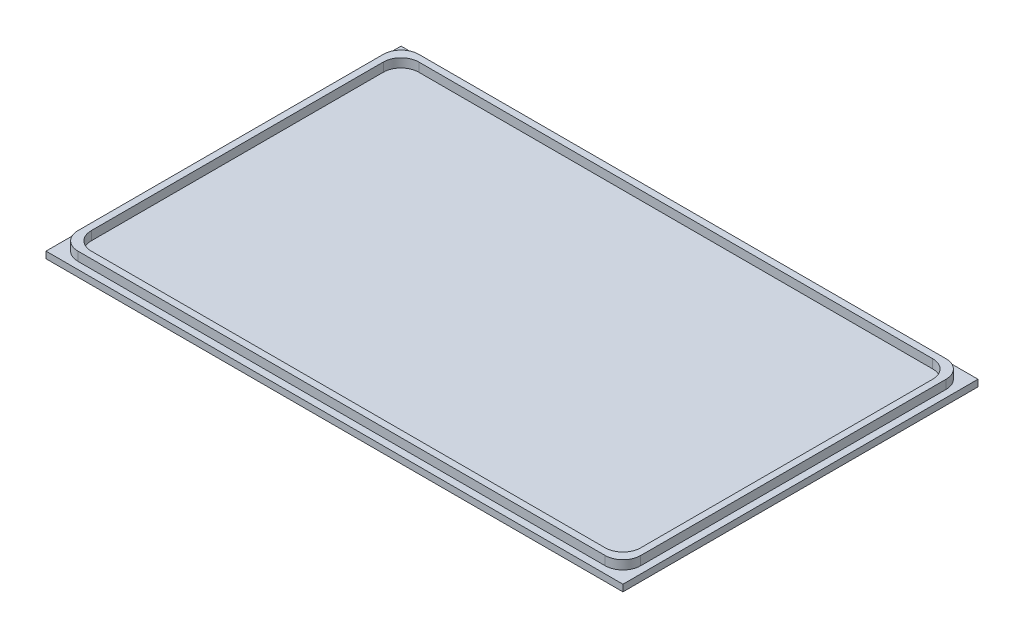
ISO-10303-21;
HEADER;
FILE_DESCRIPTION(('STEP AP214'),'2;1');
FILE_NAME('part.step','',(''),(''),'','','');
FILE_SCHEMA(('AUTOMOTIVE_DESIGN { 1 0 10303 214 1 1 1 1 }'));
ENDSEC;
DATA;
#1=APPLICATION_CONTEXT('core data for automotive mechanical design processes');
#2=APPLICATION_PROTOCOL_DEFINITION('international standard','automotive_design',2000,#1);
#3=PRODUCT_CONTEXT('',#1,'mechanical');
#4=PRODUCT('Part','Part','',(#3));
#5=PRODUCT_RELATED_PRODUCT_CATEGORY('part','',(#4));
#6=PRODUCT_DEFINITION_FORMATION('','',#4);
#7=PRODUCT_DEFINITION_CONTEXT('part definition',#1,'design');
#8=PRODUCT_DEFINITION('design','',#6,#7);
#9=PRODUCT_DEFINITION_SHAPE('','',#8);
#10=(LENGTH_UNIT() NAMED_UNIT(*) SI_UNIT(.MILLI.,.METRE.));
#11=(NAMED_UNIT(*) PLANE_ANGLE_UNIT() SI_UNIT($,.RADIAN.));
#12=(NAMED_UNIT(*) SI_UNIT($,.STERADIAN.) SOLID_ANGLE_UNIT());
#13=UNCERTAINTY_MEASURE_WITH_UNIT(LENGTH_MEASURE(1.E-05),#10,'distance_accuracy_value','');
#14=(GEOMETRIC_REPRESENTATION_CONTEXT(3) GLOBAL_UNCERTAINTY_ASSIGNED_CONTEXT((#13)) GLOBAL_UNIT_ASSIGNED_CONTEXT((#10,
#11,#12)) REPRESENTATION_CONTEXT('',''));
#15=CARTESIAN_POINT('',(0.,0.,0.));
#16=DIRECTION('',(0.,0.,1.));
#17=DIRECTION('',(1.,0.,0.));
#18=AXIS2_PLACEMENT_3D('',#15,#16,#17);
#19=CARTESIAN_POINT('',(0.,3.,0.));
#20=DIRECTION('',(0.,-1.,0.));
#21=DIRECTION('',(0.,0.,-1.));
#22=AXIS2_PLACEMENT_3D('',#19,#20,#21);
#23=PLANE('',#22);
#24=DIRECTION('',(0.,0.,-1.));
#25=VECTOR('',#24,1.);
#26=CARTESIAN_POINT('',(130.,3.,80.));
#27=LINE('',#26,#25);
#28=CARTESIAN_POINT('',(130.,3.,80.));
#29=VERTEX_POINT('',#28);
#30=CARTESIAN_POINT('',(130.,3.,-80.));
#31=VERTEX_POINT('',#30);
#32=EDGE_CURVE('E185',#29,#31,#27,.T.);
#33=ORIENTED_EDGE('',*,*,#32,.T.);
#34=DIRECTION('',(-1.,0.,0.));
#35=VECTOR('',#34,1.);
#36=CARTESIAN_POINT('',(-130.,3.,-80.));
#37=LINE('',#36,#35);
#38=CARTESIAN_POINT('',(-130.,3.,-80.));
#39=VERTEX_POINT('',#38);
#40=EDGE_CURVE('E174',#31,#39,#37,.T.);
#41=ORIENTED_EDGE('',*,*,#40,.T.);
#42=DIRECTION('',(0.,0.,1.));
#43=VECTOR('',#42,1.);
#44=CARTESIAN_POINT('',(-130.,3.,80.));
#45=LINE('',#44,#43);
#46=CARTESIAN_POINT('',(-130.,3.,80.));
#47=VERTEX_POINT('',#46);
#48=EDGE_CURVE('E184',#39,#47,#45,.T.);
#49=ORIENTED_EDGE('',*,*,#48,.T.);
#50=DIRECTION('',(1.,0.,0.));
#51=VECTOR('',#50,1.);
#52=CARTESIAN_POINT('',(-130.,3.,80.));
#53=LINE('',#52,#51);
#54=EDGE_CURVE('E189',#47,#29,#53,.T.);
#55=ORIENTED_EDGE('',*,*,#54,.T.);
#56=EDGE_LOOP('',(#33,#41,#49,#55));
#57=FACE_BOUND('',#56,.T.);
#58=DIRECTION('',(1.,0.,0.));
#59=VECTOR('',#58,1.);
#60=CARTESIAN_POINT('',(-126.8,3.,76.8));
#61=LINE('',#60,#59);
#62=CARTESIAN_POINT('',(-118.8,3.,76.8));
#63=VERTEX_POINT('',#62);
#64=CARTESIAN_POINT('',(118.8,3.,76.8));
#65=VERTEX_POINT('',#64);
#66=EDGE_CURVE('E300',#63,#65,#61,.T.);
#67=ORIENTED_EDGE('',*,*,#66,.F.);
#68=CARTESIAN_POINT('',(-118.8,3.,68.8));
#69=DIRECTION('',(0.,-1.,0.));
#70=DIRECTION('',(0.,0.,-1.));
#71=AXIS2_PLACEMENT_3D('',#68,#69,#70);
#72=CIRCLE('',#71,8.);
#73=CARTESIAN_POINT('',(-126.8,3.,68.8));
#74=VERTEX_POINT('',#73);
#75=EDGE_CURVE('E52',#63,#74,#72,.T.);
#76=ORIENTED_EDGE('',*,*,#75,.T.);
#77=DIRECTION('',(0.,0.,1.));
#78=VECTOR('',#77,1.);
#79=CARTESIAN_POINT('',(-126.8,3.,-76.8));
#80=LINE('',#79,#78);
#81=CARTESIAN_POINT('',(-126.8,3.,-68.8));
#82=VERTEX_POINT('',#81);
#83=EDGE_CURVE('E271',#82,#74,#80,.T.);
#84=ORIENTED_EDGE('',*,*,#83,.F.);
#85=CARTESIAN_POINT('',(-118.8,3.,-68.8));
#86=DIRECTION('',(0.,-1.,0.));
#87=DIRECTION('',(0.,0.,-1.));
#88=AXIS2_PLACEMENT_3D('',#85,#86,#87);
#89=CIRCLE('',#88,8.);
#90=CARTESIAN_POINT('',(-118.8,3.,-76.8));
#91=VERTEX_POINT('',#90);
#92=EDGE_CURVE('E45',#82,#91,#89,.T.);
#93=ORIENTED_EDGE('',*,*,#92,.T.);
#94=DIRECTION('',(-1.,0.,0.));
#95=VECTOR('',#94,1.);
#96=CARTESIAN_POINT('',(126.8,3.,-76.8));
#97=LINE('',#96,#95);
#98=CARTESIAN_POINT('',(118.8,3.,-76.8));
#99=VERTEX_POINT('',#98);
#100=EDGE_CURVE('E270',#99,#91,#97,.T.);
#101=ORIENTED_EDGE('',*,*,#100,.F.);
#102=CARTESIAN_POINT('',(118.8,3.,-68.8));
#103=DIRECTION('',(0.,-1.,0.));
#104=DIRECTION('',(0.,0.,-1.));
#105=AXIS2_PLACEMENT_3D('',#102,#103,#104);
#106=CIRCLE('',#105,8.);
#107=CARTESIAN_POINT('',(126.8,3.,-68.8));
#108=VERTEX_POINT('',#107);
#109=EDGE_CURVE('E258',#99,#108,#106,.T.);
#110=ORIENTED_EDGE('',*,*,#109,.T.);
#111=DIRECTION('',(0.,0.,-1.));
#112=VECTOR('',#111,1.);
#113=CARTESIAN_POINT('',(126.8,3.,76.8));
#114=LINE('',#113,#112);
#115=CARTESIAN_POINT('',(126.8,3.,68.8));
#116=VERTEX_POINT('',#115);
#117=EDGE_CURVE('E277',#116,#108,#114,.T.);
#118=ORIENTED_EDGE('',*,*,#117,.F.);
#119=CARTESIAN_POINT('',(118.8,3.,68.8));
#120=DIRECTION('',(0.,-1.,0.));
#121=DIRECTION('',(0.,0.,-1.));
#122=AXIS2_PLACEMENT_3D('',#119,#120,#121);
#123=CIRCLE('',#122,8.);
#124=EDGE_CURVE('E264',#116,#65,#123,.T.);
#125=ORIENTED_EDGE('',*,*,#124,.T.);
#126=EDGE_LOOP('',(#67,#76,#84,#93,#101,#110,#118,#125));
#127=FACE_BOUND('',#126,.T.);
#128=ADVANCED_FACE('F37',(#57,#127),#23,.F.);
#129=CARTESIAN_POINT('',(130.,3.,80.));
#130=DIRECTION('',(-1.,0.,0.));
#131=DIRECTION('',(0.,0.,1.));
#132=AXIS2_PLACEMENT_3D('',#129,#130,#131);
#133=PLANE('',#132);
#134=DIRECTION('',(0.,0.,-1.));
#135=VECTOR('',#134,1.);
#136=CARTESIAN_POINT('',(130.,0.,80.));
#137=LINE('',#136,#135);
#138=CARTESIAN_POINT('',(130.,0.,80.));
#139=VERTEX_POINT('',#138);
#140=CARTESIAN_POINT('',(130.,0.,-80.));
#141=VERTEX_POINT('',#140);
#142=EDGE_CURVE('E197',#139,#141,#137,.T.);
#143=ORIENTED_EDGE('',*,*,#142,.T.);
#144=DIRECTION('',(0.,-1.,0.));
#145=VECTOR('',#144,1.);
#146=CARTESIAN_POINT('',(130.,3.,-80.));
#147=LINE('',#146,#145);
#148=EDGE_CURVE('E178',#31,#141,#147,.T.);
#149=ORIENTED_EDGE('',*,*,#148,.F.);
#150=ORIENTED_EDGE('',*,*,#32,.F.);
#151=DIRECTION('',(0.,-1.,0.));
#152=VECTOR('',#151,1.);
#153=CARTESIAN_POINT('',(130.,3.,80.));
#154=LINE('',#153,#152);
#155=EDGE_CURVE('E309',#29,#139,#154,.T.);
#156=ORIENTED_EDGE('',*,*,#155,.T.);
#157=EDGE_LOOP('',(#143,#149,#150,#156));
#158=FACE_BOUND('',#157,.T.);
#159=ADVANCED_FACE('F195',(#158),#133,.F.);
#160=CARTESIAN_POINT('',(-130.,3.,-80.));
#161=DIRECTION('',(0.,0.,1.));
#162=DIRECTION('',(1.,0.,0.));
#163=AXIS2_PLACEMENT_3D('',#160,#161,#162);
#164=PLANE('',#163);
#165=DIRECTION('',(-1.,0.,0.));
#166=VECTOR('',#165,1.);
#167=CARTESIAN_POINT('',(-130.,0.,-80.));
#168=LINE('',#167,#166);
#169=CARTESIAN_POINT('',(-130.,0.,-80.));
#170=VERTEX_POINT('',#169);
#171=EDGE_CURVE('E294',#141,#170,#168,.T.);
#172=ORIENTED_EDGE('',*,*,#171,.T.);
#173=DIRECTION('',(0.,-1.,0.));
#174=VECTOR('',#173,1.);
#175=CARTESIAN_POINT('',(-130.,3.,-80.));
#176=LINE('',#175,#174);
#177=EDGE_CURVE('E181',#39,#170,#176,.T.);
#178=ORIENTED_EDGE('',*,*,#177,.F.);
#179=ORIENTED_EDGE('',*,*,#40,.F.);
#180=ORIENTED_EDGE('',*,*,#148,.T.);
#181=EDGE_LOOP('',(#172,#178,#179,#180));
#182=FACE_BOUND('',#181,.T.);
#183=ADVANCED_FACE('F176',(#182),#164,.F.);
#184=CARTESIAN_POINT('',(-130.,3.,80.));
#185=DIRECTION('',(1.,0.,0.));
#186=DIRECTION('',(0.,0.,-1.));
#187=AXIS2_PLACEMENT_3D('',#184,#185,#186);
#188=PLANE('',#187);
#189=DIRECTION('',(0.,0.,1.));
#190=VECTOR('',#189,1.);
#191=CARTESIAN_POINT('',(-130.,0.,80.));
#192=LINE('',#191,#190);
#193=CARTESIAN_POINT('',(-130.,0.,80.));
#194=VERTEX_POINT('',#193);
#195=EDGE_CURVE('E312',#170,#194,#192,.T.);
#196=ORIENTED_EDGE('',*,*,#195,.T.);
#197=DIRECTION('',(0.,-1.,0.));
#198=VECTOR('',#197,1.);
#199=CARTESIAN_POINT('',(-130.,3.,80.));
#200=LINE('',#199,#198);
#201=EDGE_CURVE('E202',#47,#194,#200,.T.);
#202=ORIENTED_EDGE('',*,*,#201,.F.);
#203=ORIENTED_EDGE('',*,*,#48,.F.);
#204=ORIENTED_EDGE('',*,*,#177,.T.);
#205=EDGE_LOOP('',(#196,#202,#203,#204));
#206=FACE_BOUND('',#205,.T.);
#207=ADVANCED_FACE('F324',(#206),#188,.F.);
#208=CARTESIAN_POINT('',(-130.,3.,80.));
#209=DIRECTION('',(0.,0.,-1.));
#210=DIRECTION('',(-1.,0.,0.));
#211=AXIS2_PLACEMENT_3D('',#208,#209,#210);
#212=PLANE('',#211);
#213=DIRECTION('',(1.,0.,0.));
#214=VECTOR('',#213,1.);
#215=CARTESIAN_POINT('',(-130.,0.,80.));
#216=LINE('',#215,#214);
#217=EDGE_CURVE('E193',#194,#139,#216,.T.);
#218=ORIENTED_EDGE('',*,*,#217,.T.);
#219=ORIENTED_EDGE('',*,*,#155,.F.);
#220=ORIENTED_EDGE('',*,*,#54,.F.);
#221=ORIENTED_EDGE('',*,*,#201,.T.);
#222=EDGE_LOOP('',(#218,#219,#220,#221));
#223=FACE_BOUND('',#222,.T.);
#224=ADVANCED_FACE('F319',(#223),#212,.F.);
#225=CARTESIAN_POINT('',(0.,0.,0.));
#226=DIRECTION('',(0.,-1.,0.));
#227=DIRECTION('',(0.,0.,-1.));
#228=AXIS2_PLACEMENT_3D('',#225,#226,#227);
#229=PLANE('',#228);
#230=ORIENTED_EDGE('',*,*,#142,.F.);
#231=ORIENTED_EDGE('',*,*,#217,.F.);
#232=ORIENTED_EDGE('',*,*,#195,.F.);
#233=ORIENTED_EDGE('',*,*,#171,.F.);
#234=EDGE_LOOP('',(#230,#231,#232,#233));
#235=FACE_BOUND('',#234,.T.);
#236=ADVANCED_FACE('F323',(#235),#229,.T.);
#237=CARTESIAN_POINT('',(0.,7.,0.));
#238=DIRECTION('',(0.,1.,0.));
#239=DIRECTION('',(0.,0.,1.));
#240=AXIS2_PLACEMENT_3D('',#237,#238,#239);
#241=PLANE('',#240);
#242=DIRECTION('',(0.,0.,-1.));
#243=VECTOR('',#242,1.);
#244=CARTESIAN_POINT('',(126.8,7.,76.8));
#245=LINE('',#244,#243);
#246=CARTESIAN_POINT('',(126.8,7.,68.8));
#247=VERTEX_POINT('',#246);
#248=CARTESIAN_POINT('',(126.8,7.,-68.8));
#249=VERTEX_POINT('',#248);
#250=EDGE_CURVE('E296',#247,#249,#245,.T.);
#251=ORIENTED_EDGE('',*,*,#250,.T.);
#252=CARTESIAN_POINT('',(118.8,7.,-68.8));
#253=DIRECTION('',(0.,1.,0.));
#254=DIRECTION('',(0.,0.,1.));
#255=AXIS2_PLACEMENT_3D('',#252,#253,#254);
#256=CIRCLE('',#255,8.);
#257=CARTESIAN_POINT('',(118.8,7.,-76.8));
#258=VERTEX_POINT('',#257);
#259=EDGE_CURVE('E219',#249,#258,#256,.T.);
#260=ORIENTED_EDGE('',*,*,#259,.T.);
#261=DIRECTION('',(-1.,0.,0.));
#262=VECTOR('',#261,1.);
#263=CARTESIAN_POINT('',(126.8,7.,-76.8));
#264=LINE('',#263,#262);
#265=CARTESIAN_POINT('',(-118.8,7.,-76.8));
#266=VERTEX_POINT('',#265);
#267=EDGE_CURVE('E289',#258,#266,#264,.T.);
#268=ORIENTED_EDGE('',*,*,#267,.T.);
#269=CARTESIAN_POINT('',(-118.8,7.,-68.8));
#270=DIRECTION('',(0.,1.,0.));
#271=DIRECTION('',(0.,0.,1.));
#272=AXIS2_PLACEMENT_3D('',#269,#270,#271);
#273=CIRCLE('',#272,8.);
#274=CARTESIAN_POINT('',(-126.8,7.,-68.8));
#275=VERTEX_POINT('',#274);
#276=EDGE_CURVE('E213',#266,#275,#273,.T.);
#277=ORIENTED_EDGE('',*,*,#276,.T.);
#278=DIRECTION('',(0.,0.,1.));
#279=VECTOR('',#278,1.);
#280=CARTESIAN_POINT('',(-126.8,7.,-76.8));
#281=LINE('',#280,#279);
#282=CARTESIAN_POINT('',(-126.8,7.,68.8));
#283=VERTEX_POINT('',#282);
#284=EDGE_CURVE('E287',#275,#283,#281,.T.);
#285=ORIENTED_EDGE('',*,*,#284,.T.);
#286=CARTESIAN_POINT('',(-118.8,7.,68.8));
#287=DIRECTION('',(0.,1.,0.));
#288=DIRECTION('',(0.,0.,1.));
#289=AXIS2_PLACEMENT_3D('',#286,#287,#288);
#290=CIRCLE('',#289,8.);
#291=CARTESIAN_POINT('',(-118.8,7.,76.8));
#292=VERTEX_POINT('',#291);
#293=EDGE_CURVE('E215',#283,#292,#290,.T.);
#294=ORIENTED_EDGE('',*,*,#293,.T.);
#295=DIRECTION('',(1.,0.,0.));
#296=VECTOR('',#295,1.);
#297=CARTESIAN_POINT('',(-126.8,7.,76.8));
#298=LINE('',#297,#296);
#299=CARTESIAN_POINT('',(118.8,7.,76.8));
#300=VERTEX_POINT('',#299);
#301=EDGE_CURVE('E306',#292,#300,#298,.T.);
#302=ORIENTED_EDGE('',*,*,#301,.T.);
#303=CARTESIAN_POINT('',(118.8,7.,68.8));
#304=DIRECTION('',(0.,1.,0.));
#305=DIRECTION('',(0.,0.,1.));
#306=AXIS2_PLACEMENT_3D('',#303,#304,#305);
#307=CIRCLE('',#306,8.);
#308=EDGE_CURVE('E217',#300,#247,#307,.T.);
#309=ORIENTED_EDGE('',*,*,#308,.T.);
#310=EDGE_LOOP('',(#251,#260,#268,#277,#285,#294,#302,#309));
#311=FACE_BOUND('',#310,.T.);
#312=DIRECTION('',(0.,0.,-1.));
#313=VECTOR('',#312,1.);
#314=CARTESIAN_POINT('',(123.8,7.,73.8));
#315=LINE('',#314,#313);
#316=CARTESIAN_POINT('',(123.8,7.,65.8));
#317=VERTEX_POINT('',#316);
#318=CARTESIAN_POINT('',(123.8,7.,-65.8));
#319=VERTEX_POINT('',#318);
#320=EDGE_CURVE('E424',#317,#319,#315,.T.);
#321=ORIENTED_EDGE('',*,*,#320,.F.);
#322=CARTESIAN_POINT('',(115.8,7.,65.8));
#323=DIRECTION('',(0.,1.,0.));
#324=DIRECTION('',(0.,0.,1.));
#325=AXIS2_PLACEMENT_3D('',#322,#323,#324);
#326=CIRCLE('',#325,8.);
#327=CARTESIAN_POINT('',(115.8,7.,73.8));
#328=VERTEX_POINT('',#327);
#329=EDGE_CURVE('E262',#317,#328,#326,.F.);
#330=ORIENTED_EDGE('',*,*,#329,.T.);
#331=DIRECTION('',(1.,0.,0.));
#332=VECTOR('',#331,1.);
#333=CARTESIAN_POINT('',(-123.8,7.,73.8));
#334=LINE('',#333,#332);
#335=CARTESIAN_POINT('',(-115.8,7.,73.8));
#336=VERTEX_POINT('',#335);
#337=EDGE_CURVE('E374',#336,#328,#334,.T.);
#338=ORIENTED_EDGE('',*,*,#337,.F.);
#339=CARTESIAN_POINT('',(-115.8,7.,65.8));
#340=DIRECTION('',(0.,1.,0.));
#341=DIRECTION('',(0.,0.,1.));
#342=AXIS2_PLACEMENT_3D('',#339,#340,#341);
#343=CIRCLE('',#342,8.);
#344=CARTESIAN_POINT('',(-123.8,7.,65.8));
#345=VERTEX_POINT('',#344);
#346=EDGE_CURVE('E267',#336,#345,#343,.F.);
#347=ORIENTED_EDGE('',*,*,#346,.T.);
#348=DIRECTION('',(0.,0.,1.));
#349=VECTOR('',#348,1.);
#350=CARTESIAN_POINT('',(-123.8,7.,-73.8));
#351=LINE('',#350,#349);
#352=CARTESIAN_POINT('',(-123.8,7.,-65.8));
#353=VERTEX_POINT('',#352);
#354=EDGE_CURVE('E303',#353,#345,#351,.T.);
#355=ORIENTED_EDGE('',*,*,#354,.F.);
#356=CARTESIAN_POINT('',(-115.8,7.,-65.8));
#357=DIRECTION('',(0.,1.,0.));
#358=DIRECTION('',(0.,0.,1.));
#359=AXIS2_PLACEMENT_3D('',#356,#357,#358);
#360=CIRCLE('',#359,8.);
#361=CARTESIAN_POINT('',(-115.8,7.,-73.8));
#362=VERTEX_POINT('',#361);
#363=EDGE_CURVE('E11',#353,#362,#360,.F.);
#364=ORIENTED_EDGE('',*,*,#363,.T.);
#365=DIRECTION('',(-1.,0.,0.));
#366=VECTOR('',#365,1.);
#367=CARTESIAN_POINT('',(123.8,7.,-73.8));
#368=LINE('',#367,#366);
#369=CARTESIAN_POINT('',(115.8,7.,-73.8));
#370=VERTEX_POINT('',#369);
#371=EDGE_CURVE('E419',#370,#362,#368,.T.);
#372=ORIENTED_EDGE('',*,*,#371,.F.);
#373=CARTESIAN_POINT('',(115.8,7.,-65.8));
#374=DIRECTION('',(0.,1.,0.));
#375=DIRECTION('',(0.,0.,1.));
#376=AXIS2_PLACEMENT_3D('',#373,#374,#375);
#377=CIRCLE('',#376,8.);
#378=EDGE_CURVE('E260',#370,#319,#377,.F.);
#379=ORIENTED_EDGE('',*,*,#378,.T.);
#380=EDGE_LOOP('',(#321,#330,#338,#347,#355,#364,#372,#379));
#381=FACE_BOUND('',#380,.T.);
#382=ADVANCED_FACE('F285',(#311,#381),#241,.T.);
#383=CARTESIAN_POINT('',(-126.8,7.,76.8));
#384=DIRECTION('',(0.,0.,-1.));
#385=DIRECTION('',(-1.,0.,0.));
#386=AXIS2_PLACEMENT_3D('',#383,#384,#385);
#387=PLANE('',#386);
#388=ORIENTED_EDGE('',*,*,#66,.T.);
#389=DIRECTION('',(0.,-1.,0.));
#390=VECTOR('',#389,1.);
#391=CARTESIAN_POINT('',(118.8,7.,76.8));
#392=LINE('',#391,#390);
#393=EDGE_CURVE('E247',#65,#300,#392,.F.);
#394=ORIENTED_EDGE('',*,*,#393,.T.);
#395=ORIENTED_EDGE('',*,*,#301,.F.);
#396=DIRECTION('',(0.,-1.,0.));
#397=VECTOR('',#396,1.);
#398=CARTESIAN_POINT('',(-118.8,7.,76.8));
#399=LINE('',#398,#397);
#400=EDGE_CURVE('E244',#292,#63,#399,.T.);
#401=ORIENTED_EDGE('',*,*,#400,.T.);
#402=EDGE_LOOP('',(#388,#394,#395,#401));
#403=FACE_BOUND('',#402,.T.);
#404=ADVANCED_FACE('F388',(#403),#387,.F.);
#405=CARTESIAN_POINT('',(126.8,7.,76.8));
#406=DIRECTION('',(-1.,0.,0.));
#407=DIRECTION('',(0.,0.,1.));
#408=AXIS2_PLACEMENT_3D('',#405,#406,#407);
#409=PLANE('',#408);
#410=ORIENTED_EDGE('',*,*,#117,.T.);
#411=DIRECTION('',(0.,-1.,0.));
#412=VECTOR('',#411,1.);
#413=CARTESIAN_POINT('',(126.8,7.,-68.8));
#414=LINE('',#413,#412);
#415=EDGE_CURVE('E211',#108,#249,#414,.F.);
#416=ORIENTED_EDGE('',*,*,#415,.T.);
#417=ORIENTED_EDGE('',*,*,#250,.F.);
#418=DIRECTION('',(0.,-1.,0.));
#419=VECTOR('',#418,1.);
#420=CARTESIAN_POINT('',(126.8,7.,68.8));
#421=LINE('',#420,#419);
#422=EDGE_CURVE('E208',#247,#116,#421,.T.);
#423=ORIENTED_EDGE('',*,*,#422,.T.);
#424=EDGE_LOOP('',(#410,#416,#417,#423));
#425=FACE_BOUND('',#424,.T.);
#426=ADVANCED_FACE('F383',(#425),#409,.F.);
#427=CARTESIAN_POINT('',(126.8,7.,-76.8));
#428=DIRECTION('',(0.,0.,1.));
#429=DIRECTION('',(1.,0.,0.));
#430=AXIS2_PLACEMENT_3D('',#427,#428,#429);
#431=PLANE('',#430);
#432=ORIENTED_EDGE('',*,*,#267,.F.);
#433=DIRECTION('',(0.,-1.,0.));
#434=VECTOR('',#433,1.);
#435=CARTESIAN_POINT('',(118.8,7.,-76.8));
#436=LINE('',#435,#434);
#437=EDGE_CURVE('E200',#258,#99,#436,.T.);
#438=ORIENTED_EDGE('',*,*,#437,.T.);
#439=ORIENTED_EDGE('',*,*,#100,.T.);
#440=DIRECTION('',(0.,-1.,0.));
#441=VECTOR('',#440,1.);
#442=CARTESIAN_POINT('',(-118.8,7.,-76.8));
#443=LINE('',#442,#441);
#444=EDGE_CURVE('E198',#91,#266,#443,.F.);
#445=ORIENTED_EDGE('',*,*,#444,.T.);
#446=EDGE_LOOP('',(#432,#438,#439,#445));
#447=FACE_BOUND('',#446,.T.);
#448=ADVANCED_FACE('F274',(#447),#431,.F.);
#449=CARTESIAN_POINT('',(-126.8,7.,-76.8));
#450=DIRECTION('',(1.,0.,0.));
#451=DIRECTION('',(0.,0.,-1.));
#452=AXIS2_PLACEMENT_3D('',#449,#450,#451);
#453=PLANE('',#452);
#454=ORIENTED_EDGE('',*,*,#83,.T.);
#455=DIRECTION('',(0.,-1.,0.));
#456=VECTOR('',#455,1.);
#457=CARTESIAN_POINT('',(-126.8,7.,68.8));
#458=LINE('',#457,#456);
#459=EDGE_CURVE('E251',#74,#283,#458,.F.);
#460=ORIENTED_EDGE('',*,*,#459,.T.);
#461=ORIENTED_EDGE('',*,*,#284,.F.);
#462=DIRECTION('',(0.,-1.,0.));
#463=VECTOR('',#462,1.);
#464=CARTESIAN_POINT('',(-126.8,7.,-68.8));
#465=LINE('',#464,#463);
#466=EDGE_CURVE('E249',#275,#82,#465,.T.);
#467=ORIENTED_EDGE('',*,*,#466,.T.);
#468=EDGE_LOOP('',(#454,#460,#461,#467));
#469=FACE_BOUND('',#468,.T.);
#470=ADVANCED_FACE('F291',(#469),#453,.F.);
#471=CARTESIAN_POINT('',(-123.8,7.,73.8));
#472=DIRECTION('',(0.,0.,-1.));
#473=DIRECTION('',(-1.,0.,0.));
#474=AXIS2_PLACEMENT_3D('',#471,#472,#473);
#475=PLANE('',#474);
#476=ORIENTED_EDGE('',*,*,#337,.T.);
#477=DIRECTION('',(0.,-1.,0.));
#478=VECTOR('',#477,1.);
#479=CARTESIAN_POINT('',(115.8,3.,73.8));
#480=LINE('',#479,#478);
#481=CARTESIAN_POINT('',(115.8,3.,73.8));
#482=VERTEX_POINT('',#481);
#483=EDGE_CURVE('E241',#328,#482,#480,.T.);
#484=ORIENTED_EDGE('',*,*,#483,.T.);
#485=DIRECTION('',(1.,0.,0.));
#486=VECTOR('',#485,1.);
#487=CARTESIAN_POINT('',(-123.8,3.,73.8));
#488=LINE('',#487,#486);
#489=CARTESIAN_POINT('',(-115.8,3.,73.8));
#490=VERTEX_POINT('',#489);
#491=EDGE_CURVE('E365',#490,#482,#488,.T.);
#492=ORIENTED_EDGE('',*,*,#491,.F.);
#493=DIRECTION('',(0.,-1.,0.));
#494=VECTOR('',#493,1.);
#495=CARTESIAN_POINT('',(-115.8,7.,73.8));
#496=LINE('',#495,#494);
#497=EDGE_CURVE('E239',#490,#336,#496,.F.);
#498=ORIENTED_EDGE('',*,*,#497,.T.);
#499=EDGE_LOOP('',(#476,#484,#492,#498));
#500=FACE_BOUND('',#499,.T.);
#501=ADVANCED_FACE('F433',(#500),#475,.T.);
#502=CARTESIAN_POINT('',(123.8,7.,73.8));
#503=DIRECTION('',(-1.,0.,0.));
#504=DIRECTION('',(0.,0.,1.));
#505=AXIS2_PLACEMENT_3D('',#502,#503,#504);
#506=PLANE('',#505);
#507=ORIENTED_EDGE('',*,*,#320,.T.);
#508=DIRECTION('',(0.,-1.,0.));
#509=VECTOR('',#508,1.);
#510=CARTESIAN_POINT('',(123.8,3.,-65.8));
#511=LINE('',#510,#509);
#512=CARTESIAN_POINT('',(123.8,3.,-65.8));
#513=VERTEX_POINT('',#512);
#514=EDGE_CURVE('E223',#319,#513,#511,.T.);
#515=ORIENTED_EDGE('',*,*,#514,.T.);
#516=DIRECTION('',(0.,0.,-1.));
#517=VECTOR('',#516,1.);
#518=CARTESIAN_POINT('',(123.8,3.,73.8));
#519=LINE('',#518,#517);
#520=CARTESIAN_POINT('',(123.8,3.,65.8));
#521=VERTEX_POINT('',#520);
#522=EDGE_CURVE('E358',#521,#513,#519,.T.);
#523=ORIENTED_EDGE('',*,*,#522,.F.);
#524=DIRECTION('',(0.,-1.,0.));
#525=VECTOR('',#524,1.);
#526=CARTESIAN_POINT('',(123.8,7.,65.8));
#527=LINE('',#526,#525);
#528=EDGE_CURVE('E221',#521,#317,#527,.F.);
#529=ORIENTED_EDGE('',*,*,#528,.T.);
#530=EDGE_LOOP('',(#507,#515,#523,#529));
#531=FACE_BOUND('',#530,.T.);
#532=ADVANCED_FACE('F439',(#531),#506,.T.);
#533=CARTESIAN_POINT('',(123.8,7.,-73.8));
#534=DIRECTION('',(0.,0.,1.));
#535=DIRECTION('',(1.,0.,0.));
#536=AXIS2_PLACEMENT_3D('',#533,#534,#535);
#537=PLANE('',#536);
#538=DIRECTION('',(-1.,0.,0.));
#539=VECTOR('',#538,1.);
#540=CARTESIAN_POINT('',(123.8,3.,-73.8));
#541=LINE('',#540,#539);
#542=CARTESIAN_POINT('',(115.8,3.,-73.8));
#543=VERTEX_POINT('',#542);
#544=CARTESIAN_POINT('',(-115.8,3.,-73.8));
#545=VERTEX_POINT('',#544);
#546=EDGE_CURVE('E364',#543,#545,#541,.T.);
#547=ORIENTED_EDGE('',*,*,#546,.F.);
#548=DIRECTION('',(0.,-1.,0.));
#549=VECTOR('',#548,1.);
#550=CARTESIAN_POINT('',(115.8,7.,-73.8));
#551=LINE('',#550,#549);
#552=EDGE_CURVE('E237',#543,#370,#551,.F.);
#553=ORIENTED_EDGE('',*,*,#552,.T.);
#554=ORIENTED_EDGE('',*,*,#371,.T.);
#555=DIRECTION('',(0.,-1.,0.));
#556=VECTOR('',#555,1.);
#557=CARTESIAN_POINT('',(-115.8,3.,-73.8));
#558=LINE('',#557,#556);
#559=EDGE_CURVE('E234',#362,#545,#558,.T.);
#560=ORIENTED_EDGE('',*,*,#559,.T.);
#561=EDGE_LOOP('',(#547,#553,#554,#560));
#562=FACE_BOUND('',#561,.T.);
#563=ADVANCED_FACE('F353',(#562),#537,.T.);
#564=CARTESIAN_POINT('',(-123.8,7.,-73.8));
#565=DIRECTION('',(1.,0.,0.));
#566=DIRECTION('',(0.,0.,-1.));
#567=AXIS2_PLACEMENT_3D('',#564,#565,#566);
#568=PLANE('',#567);
#569=ORIENTED_EDGE('',*,*,#354,.T.);
#570=DIRECTION('',(0.,-1.,0.));
#571=VECTOR('',#570,1.);
#572=CARTESIAN_POINT('',(-123.8,3.,65.8));
#573=LINE('',#572,#571);
#574=CARTESIAN_POINT('',(-123.8,3.,65.8));
#575=VERTEX_POINT('',#574);
#576=EDGE_CURVE('E255',#345,#575,#573,.T.);
#577=ORIENTED_EDGE('',*,*,#576,.T.);
#578=DIRECTION('',(0.,0.,1.));
#579=VECTOR('',#578,1.);
#580=CARTESIAN_POINT('',(-123.8,3.,-73.8));
#581=LINE('',#580,#579);
#582=CARTESIAN_POINT('',(-123.8,3.,-65.8));
#583=VERTEX_POINT('',#582);
#584=EDGE_CURVE('E367',#583,#575,#581,.T.);
#585=ORIENTED_EDGE('',*,*,#584,.F.);
#586=DIRECTION('',(0.,-1.,0.));
#587=VECTOR('',#586,1.);
#588=CARTESIAN_POINT('',(-123.8,7.,-65.8));
#589=LINE('',#588,#587);
#590=EDGE_CURVE('E253',#583,#353,#589,.F.);
#591=ORIENTED_EDGE('',*,*,#590,.T.);
#592=EDGE_LOOP('',(#569,#577,#585,#591));
#593=FACE_BOUND('',#592,.T.);
#594=ADVANCED_FACE('F344',(#593),#568,.T.);
#595=ORIENTED_EDGE('',*,*,#522,.T.);
#596=CARTESIAN_POINT('',(115.8,3.,-65.8));
#597=DIRECTION('',(0.,-1.,0.));
#598=DIRECTION('',(0.,0.,-1.));
#599=AXIS2_PLACEMENT_3D('',#596,#597,#598);
#600=CIRCLE('',#599,8.);
#601=EDGE_CURVE('E232',#513,#543,#600,.F.);
#602=ORIENTED_EDGE('',*,*,#601,.T.);
#603=ORIENTED_EDGE('',*,*,#546,.T.);
#604=CARTESIAN_POINT('',(-115.8,3.,-65.8));
#605=DIRECTION('',(0.,-1.,0.));
#606=DIRECTION('',(0.,0.,-1.));
#607=AXIS2_PLACEMENT_3D('',#604,#605,#606);
#608=CIRCLE('',#607,8.);
#609=EDGE_CURVE('E226',#545,#583,#608,.F.);
#610=ORIENTED_EDGE('',*,*,#609,.T.);
#611=ORIENTED_EDGE('',*,*,#584,.T.);
#612=CARTESIAN_POINT('',(-115.8,3.,65.8));
#613=DIRECTION('',(0.,-1.,0.));
#614=DIRECTION('',(0.,0.,-1.));
#615=AXIS2_PLACEMENT_3D('',#612,#613,#614);
#616=CIRCLE('',#615,8.);
#617=EDGE_CURVE('E228',#575,#490,#616,.F.);
#618=ORIENTED_EDGE('',*,*,#617,.T.);
#619=ORIENTED_EDGE('',*,*,#491,.T.);
#620=CARTESIAN_POINT('',(115.8,3.,65.8));
#621=DIRECTION('',(0.,-1.,0.));
#622=DIRECTION('',(0.,0.,-1.));
#623=AXIS2_PLACEMENT_3D('',#620,#621,#622);
#624=CIRCLE('',#623,8.);
#625=EDGE_CURVE('E230',#482,#521,#624,.F.);
#626=ORIENTED_EDGE('',*,*,#625,.T.);
#627=EDGE_LOOP('',(#595,#602,#603,#610,#611,#618,#619,#626));
#628=FACE_BOUND('',#627,.T.);
#629=ADVANCED_FACE('F335',(#628),#23,.F.);
#630=CARTESIAN_POINT('',(118.8,7.,-68.8));
#631=DIRECTION('',(0.,-1.,0.));
#632=DIRECTION('',(0.,0.,-1.));
#633=AXIS2_PLACEMENT_3D('',#630,#631,#632);
#634=CYLINDRICAL_SURFACE('',#633,8.);
#635=ORIENTED_EDGE('',*,*,#259,.F.);
#636=ORIENTED_EDGE('',*,*,#415,.F.);
#637=ORIENTED_EDGE('',*,*,#109,.F.);
#638=ORIENTED_EDGE('',*,*,#437,.F.);
#639=EDGE_LOOP('',(#635,#636,#637,#638));
#640=FACE_BOUND('',#639,.T.);
#641=ADVANCED_FACE('F343',(#640),#634,.T.);
#642=CARTESIAN_POINT('',(115.8,7.,-65.8));
#643=DIRECTION('',(0.,1.,0.));
#644=DIRECTION('',(0.,0.,1.));
#645=AXIS2_PLACEMENT_3D('',#642,#643,#644);
#646=CYLINDRICAL_SURFACE('',#645,8.);
#647=ORIENTED_EDGE('',*,*,#378,.F.);
#648=ORIENTED_EDGE('',*,*,#552,.F.);
#649=ORIENTED_EDGE('',*,*,#601,.F.);
#650=ORIENTED_EDGE('',*,*,#514,.F.);
#651=EDGE_LOOP('',(#647,#648,#649,#650));
#652=FACE_BOUND('',#651,.T.);
#653=ADVANCED_FACE('F350',(#652),#646,.F.);
#654=CARTESIAN_POINT('',(115.8,7.,65.8));
#655=DIRECTION('',(0.,1.,0.));
#656=DIRECTION('',(0.,0.,1.));
#657=AXIS2_PLACEMENT_3D('',#654,#655,#656);
#658=CYLINDRICAL_SURFACE('',#657,8.);
#659=ORIENTED_EDGE('',*,*,#329,.F.);
#660=ORIENTED_EDGE('',*,*,#528,.F.);
#661=ORIENTED_EDGE('',*,*,#625,.F.);
#662=ORIENTED_EDGE('',*,*,#483,.F.);
#663=EDGE_LOOP('',(#659,#660,#661,#662));
#664=FACE_BOUND('',#663,.T.);
#665=ADVANCED_FACE('F402',(#664),#658,.F.);
#666=CARTESIAN_POINT('',(118.8,7.,68.8));
#667=DIRECTION('',(0.,-1.,0.));
#668=DIRECTION('',(0.,0.,-1.));
#669=AXIS2_PLACEMENT_3D('',#666,#667,#668);
#670=CYLINDRICAL_SURFACE('',#669,8.);
#671=ORIENTED_EDGE('',*,*,#308,.F.);
#672=ORIENTED_EDGE('',*,*,#393,.F.);
#673=ORIENTED_EDGE('',*,*,#124,.F.);
#674=ORIENTED_EDGE('',*,*,#422,.F.);
#675=EDGE_LOOP('',(#671,#672,#673,#674));
#676=FACE_BOUND('',#675,.T.);
#677=ADVANCED_FACE('F385',(#676),#670,.T.);
#678=CARTESIAN_POINT('',(-118.8,7.,68.8));
#679=DIRECTION('',(0.,-1.,0.));
#680=DIRECTION('',(0.,0.,-1.));
#681=AXIS2_PLACEMENT_3D('',#678,#679,#680);
#682=CYLINDRICAL_SURFACE('',#681,8.);
#683=ORIENTED_EDGE('',*,*,#293,.F.);
#684=ORIENTED_EDGE('',*,*,#459,.F.);
#685=ORIENTED_EDGE('',*,*,#75,.F.);
#686=ORIENTED_EDGE('',*,*,#400,.F.);
#687=EDGE_LOOP('',(#683,#684,#685,#686));
#688=FACE_BOUND('',#687,.T.);
#689=ADVANCED_FACE('F392',(#688),#682,.T.);
#690=CARTESIAN_POINT('',(-115.8,7.,65.8));
#691=DIRECTION('',(0.,1.,0.));
#692=DIRECTION('',(0.,0.,1.));
#693=AXIS2_PLACEMENT_3D('',#690,#691,#692);
#694=CYLINDRICAL_SURFACE('',#693,8.);
#695=ORIENTED_EDGE('',*,*,#346,.F.);
#696=ORIENTED_EDGE('',*,*,#497,.F.);
#697=ORIENTED_EDGE('',*,*,#617,.F.);
#698=ORIENTED_EDGE('',*,*,#576,.F.);
#699=EDGE_LOOP('',(#695,#696,#697,#698));
#700=FACE_BOUND('',#699,.T.);
#701=ADVANCED_FACE('F394',(#700),#694,.F.);
#702=CARTESIAN_POINT('',(-118.8,7.,-68.8));
#703=DIRECTION('',(0.,-1.,0.));
#704=DIRECTION('',(0.,0.,-1.));
#705=AXIS2_PLACEMENT_3D('',#702,#703,#704);
#706=CYLINDRICAL_SURFACE('',#705,8.);
#707=ORIENTED_EDGE('',*,*,#276,.F.);
#708=ORIENTED_EDGE('',*,*,#444,.F.);
#709=ORIENTED_EDGE('',*,*,#92,.F.);
#710=ORIENTED_EDGE('',*,*,#466,.F.);
#711=EDGE_LOOP('',(#707,#708,#709,#710));
#712=FACE_BOUND('',#711,.T.);
#713=ADVANCED_FACE('F280',(#712),#706,.T.);
#714=CARTESIAN_POINT('',(-115.8,7.,-65.8));
#715=DIRECTION('',(0.,1.,0.));
#716=DIRECTION('',(0.,0.,1.));
#717=AXIS2_PLACEMENT_3D('',#714,#715,#716);
#718=CYLINDRICAL_SURFACE('',#717,8.);
#719=ORIENTED_EDGE('',*,*,#363,.F.);
#720=ORIENTED_EDGE('',*,*,#590,.F.);
#721=ORIENTED_EDGE('',*,*,#609,.F.);
#722=ORIENTED_EDGE('',*,*,#559,.F.);
#723=EDGE_LOOP('',(#719,#720,#721,#722));
#724=FACE_BOUND('',#723,.T.);
#725=ADVANCED_FACE('F39',(#724),#718,.F.);
#726=CLOSED_SHELL('',(#128,#159,#183,#207,#224,#236,#382,#404,#426,#448,#470,#501,#532,#563,
#594,#629,#641,#653,#665,#677,#689,#701,#713,#725));
#727=MANIFOLD_SOLID_BREP('B2',#726);
#728=ADVANCED_BREP_SHAPE_REPRESENTATION('',(#18,#727),#14);
#729=SHAPE_DEFINITION_REPRESENTATION(#9,#728);
ENDSEC;
END-ISO-10303-21;
